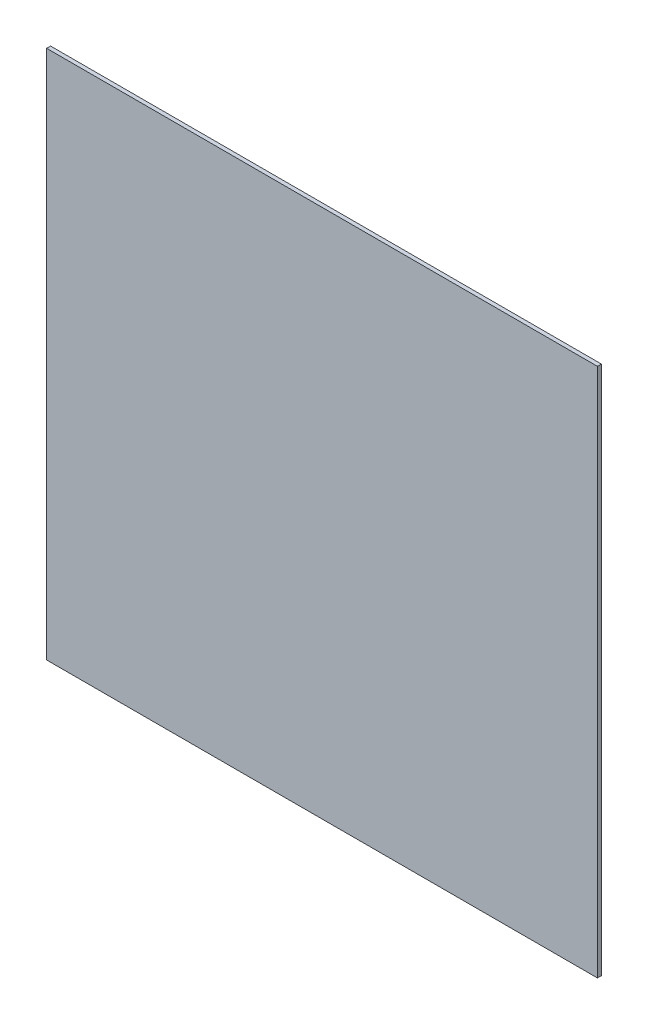
ISO-10303-21;
HEADER;
FILE_DESCRIPTION(('STEP AP214'),'2;1');
FILE_NAME('part.step','',(''),(''),'','','');
FILE_SCHEMA(('AUTOMOTIVE_DESIGN { 1 0 10303 214 1 1 1 1 }'));
ENDSEC;
DATA;
#1=APPLICATION_CONTEXT('core data for automotive mechanical design processes');
#2=APPLICATION_PROTOCOL_DEFINITION('international standard','automotive_design',2000,#1);
#3=PRODUCT_CONTEXT('',#1,'mechanical');
#4=PRODUCT('Part','Part','',(#3));
#5=PRODUCT_RELATED_PRODUCT_CATEGORY('part','',(#4));
#6=PRODUCT_DEFINITION_FORMATION('','',#4);
#7=PRODUCT_DEFINITION_CONTEXT('part definition',#1,'design');
#8=PRODUCT_DEFINITION('design','',#6,#7);
#9=PRODUCT_DEFINITION_SHAPE('','',#8);
#10=(LENGTH_UNIT() NAMED_UNIT(*) SI_UNIT(.MILLI.,.METRE.));
#11=(NAMED_UNIT(*) PLANE_ANGLE_UNIT() SI_UNIT($,.RADIAN.));
#12=(NAMED_UNIT(*) SI_UNIT($,.STERADIAN.) SOLID_ANGLE_UNIT());
#13=UNCERTAINTY_MEASURE_WITH_UNIT(LENGTH_MEASURE(1.E-05),#10,'distance_accuracy_value','');
#14=(GEOMETRIC_REPRESENTATION_CONTEXT(3) GLOBAL_UNCERTAINTY_ASSIGNED_CONTEXT((#13)) GLOBAL_UNIT_ASSIGNED_CONTEXT((#10,
#11,#12)) REPRESENTATION_CONTEXT('',''));
#15=CARTESIAN_POINT('',(0.,0.,0.));
#16=DIRECTION('',(0.,0.,1.));
#17=DIRECTION('',(1.,0.,0.));
#18=AXIS2_PLACEMENT_3D('',#15,#16,#17);
#19=CARTESIAN_POINT('',(208.661,200.66,2.9972));
#20=DIRECTION('',(-1.,0.,0.));
#21=DIRECTION('',(0.,-1.,0.));
#22=AXIS2_PLACEMENT_3D('',#19,#20,#21);
#23=PLANE('',#22);
#24=DIRECTION('',(0.,1.,0.));
#25=VECTOR('',#24,1.);
#26=CARTESIAN_POINT('',(208.661,200.66,0.));
#27=LINE('',#26,#25);
#28=CARTESIAN_POINT('',(208.661,-200.66,0.));
#29=VERTEX_POINT('',#28);
#30=CARTESIAN_POINT('',(208.661,200.66,0.));
#31=VERTEX_POINT('',#30);
#32=EDGE_CURVE('E107',#29,#31,#27,.T.);
#33=ORIENTED_EDGE('',*,*,#32,.T.);
#34=DIRECTION('',(0.,0.,-1.));
#35=VECTOR('',#34,1.);
#36=CARTESIAN_POINT('',(208.661,200.66,2.9972));
#37=LINE('',#36,#35);
#38=CARTESIAN_POINT('',(208.661,200.66,2.9972));
#39=VERTEX_POINT('',#38);
#40=EDGE_CURVE('E11',#39,#31,#37,.T.);
#41=ORIENTED_EDGE('',*,*,#40,.F.);
#42=DIRECTION('',(0.,1.,0.));
#43=VECTOR('',#42,1.);
#44=CARTESIAN_POINT('',(208.661,200.66,2.9972));
#45=LINE('',#44,#43);
#46=CARTESIAN_POINT('',(208.661,-200.66,2.9972));
#47=VERTEX_POINT('',#46);
#48=EDGE_CURVE('E91',#47,#39,#45,.T.);
#49=ORIENTED_EDGE('',*,*,#48,.F.);
#50=DIRECTION('',(0.,0.,-1.));
#51=VECTOR('',#50,1.);
#52=CARTESIAN_POINT('',(208.661,-200.66,2.9972));
#53=LINE('',#52,#51);
#54=EDGE_CURVE('E103',#47,#29,#53,.T.);
#55=ORIENTED_EDGE('',*,*,#54,.T.);
#56=EDGE_LOOP('',(#33,#41,#49,#55));
#57=FACE_BOUND('',#56,.T.);
#58=ADVANCED_FACE('F39',(#57),#23,.F.);
#59=CARTESIAN_POINT('',(-208.661,200.66,2.9972));
#60=DIRECTION('',(0.,-1.,0.));
#61=DIRECTION('',(0.,0.,-1.));
#62=AXIS2_PLACEMENT_3D('',#59,#60,#61);
#63=PLANE('',#62);
#64=DIRECTION('',(-1.,0.,0.));
#65=VECTOR('',#64,1.);
#66=CARTESIAN_POINT('',(-208.661,200.66,0.));
#67=LINE('',#66,#65);
#68=CARTESIAN_POINT('',(-208.661,200.66,0.));
#69=VERTEX_POINT('',#68);
#70=EDGE_CURVE('E96',#31,#69,#67,.T.);
#71=ORIENTED_EDGE('',*,*,#70,.T.);
#72=DIRECTION('',(0.,0.,-1.));
#73=VECTOR('',#72,1.);
#74=CARTESIAN_POINT('',(-208.661,200.66,2.9972));
#75=LINE('',#74,#73);
#76=CARTESIAN_POINT('',(-208.661,200.66,2.9972));
#77=VERTEX_POINT('',#76);
#78=EDGE_CURVE('E48',#77,#69,#75,.T.);
#79=ORIENTED_EDGE('',*,*,#78,.F.);
#80=DIRECTION('',(-1.,0.,0.));
#81=VECTOR('',#80,1.);
#82=CARTESIAN_POINT('',(-208.661,200.66,2.9972));
#83=LINE('',#82,#81);
#84=EDGE_CURVE('E86',#39,#77,#83,.T.);
#85=ORIENTED_EDGE('',*,*,#84,.F.);
#86=ORIENTED_EDGE('',*,*,#40,.T.);
#87=EDGE_LOOP('',(#71,#79,#85,#86));
#88=FACE_BOUND('',#87,.T.);
#89=ADVANCED_FACE('F95',(#88),#63,.F.);
#90=CARTESIAN_POINT('',(-208.661,200.66,2.9972));
#91=DIRECTION('',(1.,0.,0.));
#92=DIRECTION('',(0.,1.,0.));
#93=AXIS2_PLACEMENT_3D('',#90,#91,#92);
#94=PLANE('',#93);
#95=DIRECTION('',(0.,-1.,0.));
#96=VECTOR('',#95,1.);
#97=CARTESIAN_POINT('',(-208.661,200.66,0.));
#98=LINE('',#97,#96);
#99=CARTESIAN_POINT('',(-208.661,-200.66,0.));
#100=VERTEX_POINT('',#99);
#101=EDGE_CURVE('E73',#69,#100,#98,.T.);
#102=ORIENTED_EDGE('',*,*,#101,.T.);
#103=DIRECTION('',(0.,0.,-1.));
#104=VECTOR('',#103,1.);
#105=CARTESIAN_POINT('',(-208.661,-200.66,2.9972));
#106=LINE('',#105,#104);
#107=CARTESIAN_POINT('',(-208.661,-200.66,2.9972));
#108=VERTEX_POINT('',#107);
#109=EDGE_CURVE('E98',#108,#100,#106,.T.);
#110=ORIENTED_EDGE('',*,*,#109,.F.);
#111=DIRECTION('',(0.,-1.,0.));
#112=VECTOR('',#111,1.);
#113=CARTESIAN_POINT('',(-208.661,200.66,2.9972));
#114=LINE('',#113,#112);
#115=EDGE_CURVE('E89',#77,#108,#114,.T.);
#116=ORIENTED_EDGE('',*,*,#115,.F.);
#117=ORIENTED_EDGE('',*,*,#78,.T.);
#118=EDGE_LOOP('',(#102,#110,#116,#117));
#119=FACE_BOUND('',#118,.T.);
#120=ADVANCED_FACE('F99',(#119),#94,.F.);
#121=CARTESIAN_POINT('',(-208.661,-200.66,2.9972));
#122=DIRECTION('',(0.,1.,0.));
#123=DIRECTION('',(0.,0.,1.));
#124=AXIS2_PLACEMENT_3D('',#121,#122,#123);
#125=PLANE('',#124);
#126=DIRECTION('',(1.,0.,0.));
#127=VECTOR('',#126,1.);
#128=CARTESIAN_POINT('',(-208.661,-200.66,0.));
#129=LINE('',#128,#127);
#130=EDGE_CURVE('E79',#100,#29,#129,.T.);
#131=ORIENTED_EDGE('',*,*,#130,.T.);
#132=ORIENTED_EDGE('',*,*,#54,.F.);
#133=DIRECTION('',(1.,0.,0.));
#134=VECTOR('',#133,1.);
#135=CARTESIAN_POINT('',(-208.661,-200.66,2.9972));
#136=LINE('',#135,#134);
#137=EDGE_CURVE('E56',#108,#47,#136,.T.);
#138=ORIENTED_EDGE('',*,*,#137,.F.);
#139=ORIENTED_EDGE('',*,*,#109,.T.);
#140=EDGE_LOOP('',(#131,#132,#138,#139));
#141=FACE_BOUND('',#140,.T.);
#142=ADVANCED_FACE('F120',(#141),#125,.F.);
#143=CARTESIAN_POINT('',(0.,0.,2.9972));
#144=DIRECTION('',(0.,0.,1.));
#145=DIRECTION('',(1.,0.,0.));
#146=AXIS2_PLACEMENT_3D('',#143,#144,#145);
#147=PLANE('',#146);
#148=ORIENTED_EDGE('',*,*,#48,.T.);
#149=ORIENTED_EDGE('',*,*,#84,.T.);
#150=ORIENTED_EDGE('',*,*,#115,.T.);
#151=ORIENTED_EDGE('',*,*,#137,.T.);
#152=EDGE_LOOP('',(#148,#149,#150,#151));
#153=FACE_BOUND('',#152,.T.);
#154=ADVANCED_FACE('F87',(#153),#147,.T.);
#155=CARTESIAN_POINT('',(0.,0.,0.));
#156=DIRECTION('',(0.,0.,1.));
#157=DIRECTION('',(1.,0.,0.));
#158=AXIS2_PLACEMENT_3D('',#155,#156,#157);
#159=PLANE('',#158);
#160=ORIENTED_EDGE('',*,*,#32,.F.);
#161=ORIENTED_EDGE('',*,*,#130,.F.);
#162=ORIENTED_EDGE('',*,*,#101,.F.);
#163=ORIENTED_EDGE('',*,*,#70,.F.);
#164=EDGE_LOOP('',(#160,#161,#162,#163));
#165=FACE_BOUND('',#164,.T.);
#166=ADVANCED_FACE('F123',(#165),#159,.F.);
#167=CLOSED_SHELL('',(#58,#89,#120,#142,#154,#166));
#168=MANIFOLD_SOLID_BREP('B2',#167);
#169=ADVANCED_BREP_SHAPE_REPRESENTATION('',(#18,#168),#14);
#170=SHAPE_DEFINITION_REPRESENTATION(#9,#169);
ENDSEC;
END-ISO-10303-21;
